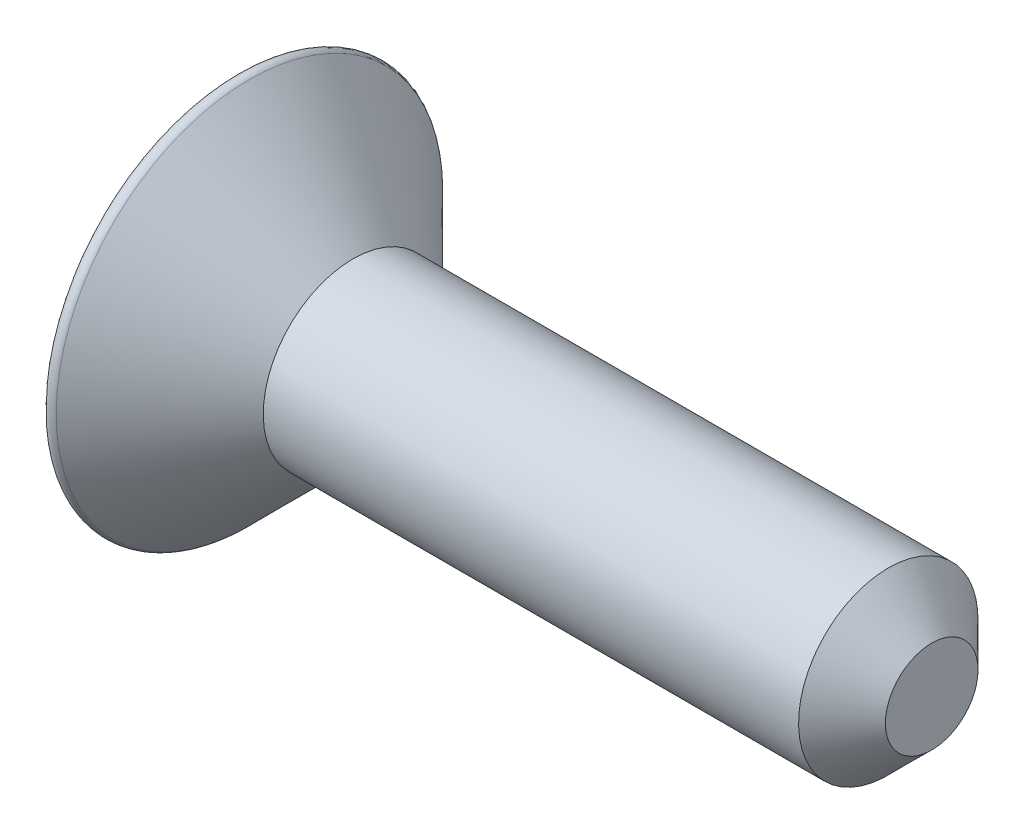
ISO-10303-21;
HEADER;
FILE_DESCRIPTION(('STEP AP214'),'2;1');
FILE_NAME('part.step','',(''),(''),'','','');
FILE_SCHEMA(('AUTOMOTIVE_DESIGN { 1 0 10303 214 1 1 1 1 }'));
ENDSEC;
DATA;
#1=APPLICATION_CONTEXT('core data for automotive mechanical design processes');
#2=APPLICATION_PROTOCOL_DEFINITION('international standard','automotive_design',2000,#1);
#3=PRODUCT_CONTEXT('',#1,'mechanical');
#4=PRODUCT('Part','Part','',(#3));
#5=PRODUCT_RELATED_PRODUCT_CATEGORY('part','',(#4));
#6=PRODUCT_DEFINITION_FORMATION('','',#4);
#7=PRODUCT_DEFINITION_CONTEXT('part definition',#1,'design');
#8=PRODUCT_DEFINITION('design','',#6,#7);
#9=PRODUCT_DEFINITION_SHAPE('','',#8);
#10=(LENGTH_UNIT() NAMED_UNIT(*) SI_UNIT(.MILLI.,.METRE.));
#11=(NAMED_UNIT(*) PLANE_ANGLE_UNIT() SI_UNIT($,.RADIAN.));
#12=(NAMED_UNIT(*) SI_UNIT($,.STERADIAN.) SOLID_ANGLE_UNIT());
#13=UNCERTAINTY_MEASURE_WITH_UNIT(LENGTH_MEASURE(1.E-05),#10,'distance_accuracy_value','');
#14=(GEOMETRIC_REPRESENTATION_CONTEXT(3) GLOBAL_UNCERTAINTY_ASSIGNED_CONTEXT((#13)) GLOBAL_UNIT_ASSIGNED_CONTEXT((#10,
#11,#12)) REPRESENTATION_CONTEXT('',''));
#15=CARTESIAN_POINT('',(0.,0.,0.));
#16=DIRECTION('',(0.,0.,1.));
#17=DIRECTION('',(1.,0.,0.));
#18=AXIS2_PLACEMENT_3D('',#15,#16,#17);
#19=CARTESIAN_POINT('',(0.,0.,0.));
#20=DIRECTION('',(1.00000000000002,0.,0.));
#21=DIRECTION('',(0.,1.00000000000002,0.));
#22=AXIS2_PLACEMENT_3D('',#19,#20,#21);
#23=PLANE('',#22);
#24=CARTESIAN_POINT('',(0.,0.,0.));
#25=DIRECTION('',(1.00000000000002,0.,0.));
#26=DIRECTION('',(0.,1.00000000000002,0.));
#27=AXIS2_PLACEMENT_3D('',#24,#25,#26);
#28=CIRCLE('',#27,0.812799999999999);
#29=CARTESIAN_POINT('',(0.,0.812800000000014,0.));
#30=VERTEX_POINT('',#29);
#31=EDGE_CURVE('E13',#30,#30,#28,.T.);
#32=ORIENTED_EDGE('',*,*,#31,.T.);
#33=EDGE_LOOP('',(#32));
#34=FACE_BOUND('',#33,.T.);
#35=ADVANCED_FACE('F50',(#34),#23,.T.);
#36=CARTESIAN_POINT('',(0.,0.,0.));
#37=DIRECTION('',(-1.00000000000002,0.,0.));
#38=DIRECTION('',(0.,-1.00000000000002,0.));
#39=AXIS2_PLACEMENT_3D('',#36,#37,#38);
#40=CONICAL_SURFACE('',#39,0.812799999999999,0.785398163397449);
#41=CARTESIAN_POINT('',(-0.76200000000004,-1.11022302462516E-13,0.));
#42=DIRECTION('',(1.00000000000002,0.,0.));
#43=DIRECTION('',(0.,1.00000000000002,0.));
#44=AXIS2_PLACEMENT_3D('',#41,#42,#43);
#45=CIRCLE('',#44,1.5748);
#46=CARTESIAN_POINT('',(-0.76200000000004,1.57479999999992,0.));
#47=VERTEX_POINT('',#46);
#48=EDGE_CURVE('E57',#47,#47,#45,.T.);
#49=ORIENTED_EDGE('',*,*,#48,.T.);
#50=EDGE_LOOP('',(#49));
#51=FACE_BOUND('',#50,.T.);
#52=ORIENTED_EDGE('',*,*,#31,.F.);
#53=EDGE_LOOP('',(#52));
#54=FACE_BOUND('',#53,.T.);
#55=ADVANCED_FACE('F208',(#51,#54),#40,.T.);
#56=CARTESIAN_POINT('',(0.,0.,0.));
#57=DIRECTION('',(1.00000000000002,0.,0.));
#58=DIRECTION('',(0.,1.00000000000002,0.));
#59=AXIS2_PLACEMENT_3D('',#56,#57,#58);
#60=CYLINDRICAL_SURFACE('',#59,1.5748);
#61=CARTESIAN_POINT('',(-10.1581948775786,-1.66533453693773E-13,0.));
#62=DIRECTION('',(1.00000000000002,0.,0.));
#63=DIRECTION('',(0.,1.00000000000002,0.));
#64=AXIS2_PLACEMENT_3D('',#61,#62,#63);
#65=CIRCLE('',#64,1.5748);
#66=CARTESIAN_POINT('',(-10.1581948775786,1.57479999999986,0.));
#67=VERTEX_POINT('',#66);
#68=EDGE_CURVE('E203',#67,#67,#65,.T.);
#69=ORIENTED_EDGE('',*,*,#68,.T.);
#70=EDGE_LOOP('',(#69));
#71=FACE_BOUND('',#70,.T.);
#72=ORIENTED_EDGE('',*,*,#48,.F.);
#73=EDGE_LOOP('',(#72));
#74=FACE_BOUND('',#73,.T.);
#75=ADVANCED_FACE('F211',(#71,#74),#60,.T.);
#76=CARTESIAN_POINT('',(-10.1581948775786,-1.66533453693773E-13,0.));
#77=DIRECTION('',(-1.00000000000002,0.,0.));
#78=DIRECTION('',(0.,-1.00000000000002,0.));
#79=AXIS2_PLACEMENT_3D('',#76,#77,#78);
#80=CONICAL_SURFACE('',#79,1.5748,0.785398163397453);
#81=CARTESIAN_POINT('',(-11.9751974387892,-3.05311331771918E-13,0.));
#82=DIRECTION('',(1.00000000000002,0.,0.));
#83=DIRECTION('',(0.,1.00000000000002,0.));
#84=AXIS2_PLACEMENT_3D('',#81,#82,#83);
#85=CIRCLE('',#84,3.39180256121069);
#86=CARTESIAN_POINT('',(-11.9751974387892,3.39180256121044,0.));
#87=VERTEX_POINT('',#86);
#88=EDGE_CURVE('E200',#87,#87,#85,.T.);
#89=ORIENTED_EDGE('',*,*,#88,.T.);
#90=EDGE_LOOP('',(#89));
#91=FACE_BOUND('',#90,.T.);
#92=ORIENTED_EDGE('',*,*,#68,.F.);
#93=EDGE_LOOP('',(#92));
#94=FACE_BOUND('',#93,.T.);
#95=ADVANCED_FACE('F213',(#91,#94),#80,.T.);
#96=CARTESIAN_POINT('',(-12.065,-3.33066907387547E-13,0.));
#97=DIRECTION('',(1.00000000000002,0.,0.));
#98=DIRECTION('',(0.,1.00000000000002,0.));
#99=AXIS2_PLACEMENT_3D('',#96,#97,#98);
#100=TOROIDAL_SURFACE('',#99,3.302,0.126999999999998);
#101=CARTESIAN_POINT('',(-12.1919999999999,-2.77555756156289E-13,0.));
#102=DIRECTION('',(1.00000000000002,0.,0.));
#103=DIRECTION('',(0.,1.00000000000002,0.));
#104=AXIS2_PLACEMENT_3D('',#101,#102,#103);
#105=CIRCLE('',#104,3.302);
#106=CARTESIAN_POINT('',(-12.1919999999999,3.30199999999978,0.));
#107=VERTEX_POINT('',#106);
#108=EDGE_CURVE('E197',#107,#107,#105,.T.);
#109=ORIENTED_EDGE('',*,*,#108,.T.);
#110=EDGE_LOOP('',(#109));
#111=FACE_BOUND('',#110,.T.);
#112=ORIENTED_EDGE('',*,*,#88,.F.);
#113=EDGE_LOOP('',(#112));
#114=FACE_BOUND('',#113,.T.);
#115=ADVANCED_FACE('F220',(#111,#114),#100,.T.);
#116=CARTESIAN_POINT('',(-12.1919999999999,-2.77555756156289E-13,0.));
#117=DIRECTION('',(-1.00000000000002,0.,0.));
#118=DIRECTION('',(0.,-1.00000000000002,0.));
#119=AXIS2_PLACEMENT_3D('',#116,#117,#118);
#120=PLANE('',#119);
#121=DIRECTION('',(0.,0.,-0.999999999999999));
#122=VECTOR('',#121,1.);
#123=CARTESIAN_POINT('',(-12.1919999999999,0.291765623733592,-0.292651894255841));
#124=LINE('',#123,#122);
#125=CARTESIAN_POINT('',(-12.1919999999999,0.291765623733592,-0.292651894255841));
#126=VERTEX_POINT('',#125);
#127=CARTESIAN_POINT('',(-12.1919999999999,0.291765623733592,-2.64590764398512));
#128=VERTEX_POINT('',#127);
#129=EDGE_CURVE('E146',#126,#128,#124,.T.);
#130=ORIENTED_EDGE('',*,*,#129,.F.);
#131=DIRECTION('',(0.,-1.00000000000002,0.));
#132=VECTOR('',#131,1.);
#133=CARTESIAN_POINT('',(-12.1919999999999,0.291765623733592,-0.292651894255841));
#134=LINE('',#133,#132);
#135=CARTESIAN_POINT('',(-12.1920000000001,2.65394488263848,-0.292651894255896));
#136=VERTEX_POINT('',#135);
#137=EDGE_CURVE('E125',#136,#126,#134,.T.);
#138=ORIENTED_EDGE('',*,*,#137,.F.);
#139=DIRECTION('',(0.,0.,-0.999999999999999));
#140=VECTOR('',#139,1.);
#141=CARTESIAN_POINT('',(-12.1920000000001,2.65394488263848,-0.292651894255896));
#142=LINE('',#141,#140);
#143=CARTESIAN_POINT('',(-12.1920000000001,2.6539448826383,0.292651894255994));
#144=VERTEX_POINT('',#143);
#145=EDGE_CURVE('E135',#144,#136,#142,.T.);
#146=ORIENTED_EDGE('',*,*,#145,.F.);
#147=DIRECTION('',(0.,1.00000000000002,0.));
#148=VECTOR('',#147,1.);
#149=CARTESIAN_POINT('',(-12.192,0.291765623733675,0.29265189425598));
#150=LINE('',#149,#148);
#151=CARTESIAN_POINT('',(-12.192,0.291765623733675,0.29265189425598));
#152=VERTEX_POINT('',#151);
#153=EDGE_CURVE('E132',#152,#144,#150,.T.);
#154=ORIENTED_EDGE('',*,*,#153,.F.);
#155=DIRECTION('',(0.,0.,-0.999999999999998));
#156=VECTOR('',#155,1.);
#157=CARTESIAN_POINT('',(-12.1919999999998,0.291765623733675,2.64590764398516));
#158=LINE('',#157,#156);
#159=CARTESIAN_POINT('',(-12.1919999999998,0.291765623733675,2.64590764398516));
#160=VERTEX_POINT('',#159);
#161=EDGE_CURVE('E169',#160,#152,#158,.T.);
#162=ORIENTED_EDGE('',*,*,#161,.F.);
#163=DIRECTION('',(0.,1.00000000000002,0.));
#164=VECTOR('',#163,1.);
#165=CARTESIAN_POINT('',(-12.1919999999998,0.291765623733675,2.64590764398516));
#166=LINE('',#165,#164);
#167=CARTESIAN_POINT('',(-12.192,-0.291765623733814,2.64590764398528));
#168=VERTEX_POINT('',#167);
#169=EDGE_CURVE('E166',#168,#160,#166,.T.);
#170=ORIENTED_EDGE('',*,*,#169,.F.);
#171=DIRECTION('',(0.,0.,0.999999999999999));
#172=VECTOR('',#171,1.);
#173=CARTESIAN_POINT('',(-12.192,-0.291765623733814,2.64590764398528));
#174=LINE('',#173,#172);
#175=CARTESIAN_POINT('',(-12.192,-0.291765623733869,0.292651894255896));
#176=VERTEX_POINT('',#175);
#177=EDGE_CURVE('E163',#176,#168,#174,.T.);
#178=ORIENTED_EDGE('',*,*,#177,.F.);
#179=DIRECTION('',(0.,1.00000000000002,0.));
#180=VECTOR('',#179,1.);
#181=CARTESIAN_POINT('',(-12.1920000000001,-2.65394488263881,0.292651894255896));
#182=LINE('',#181,#180);
#183=CARTESIAN_POINT('',(-12.1920000000001,-2.65394488263881,0.292651894255896));
#184=VERTEX_POINT('',#183);
#185=EDGE_CURVE('E160',#184,#176,#182,.T.);
#186=ORIENTED_EDGE('',*,*,#185,.F.);
#187=DIRECTION('',(0.,0.,0.999999999999999));
#188=VECTOR('',#187,1.);
#189=CARTESIAN_POINT('',(-12.192,-2.65394488263843,-0.292651894255896));
#190=LINE('',#189,#188);
#191=CARTESIAN_POINT('',(-12.192,-2.65394488263843,-0.292651894255896));
#192=VERTEX_POINT('',#191);
#193=EDGE_CURVE('E157',#192,#184,#190,.T.);
#194=ORIENTED_EDGE('',*,*,#193,.F.);
#195=DIRECTION('',(0.,-1.00000000000002,0.));
#196=VECTOR('',#195,1.);
#197=CARTESIAN_POINT('',(-12.192,-2.65394488263843,-0.292651894255896));
#198=LINE('',#197,#196);
#199=CARTESIAN_POINT('',(-12.1920000000002,-0.291765623734008,-0.292651894255855));
#200=VERTEX_POINT('',#199);
#201=EDGE_CURVE('E154',#200,#192,#198,.T.);
#202=ORIENTED_EDGE('',*,*,#201,.F.);
#203=DIRECTION('',(0.,0.,0.999999999999998));
#204=VECTOR('',#203,1.);
#205=CARTESIAN_POINT('',(-12.1920000000002,-0.291765623734008,-0.292651894255855));
#206=LINE('',#205,#204);
#207=CARTESIAN_POINT('',(-12.1919999999998,-0.291765623733828,-2.64590764398501));
#208=VERTEX_POINT('',#207);
#209=EDGE_CURVE('E64',#208,#200,#206,.T.);
#210=ORIENTED_EDGE('',*,*,#209,.F.);
#211=DIRECTION('',(0.,-1.00000000000002,0.));
#212=VECTOR('',#211,1.);
#213=CARTESIAN_POINT('',(-12.1919999999999,0.291765623733592,-2.64590764398512));
#214=LINE('',#213,#212);
#215=EDGE_CURVE('E148',#128,#208,#214,.T.);
#216=ORIENTED_EDGE('',*,*,#215,.F.);
#217=EDGE_LOOP('',(#130,#138,#146,#154,#162,#170,#178,#186,#194,#202,#210,#216));
#218=FACE_BOUND('',#217,.T.);
#219=ORIENTED_EDGE('',*,*,#108,.F.);
#220=EDGE_LOOP('',(#219));
#221=FACE_BOUND('',#220,.T.);
#222=ADVANCED_FACE('F142',(#218,#221),#120,.T.);
#223=CARTESIAN_POINT('',(-12.1920000000001,2.65394488263848,-0.292651894255896));
#224=DIRECTION('',(0.559192903470757,0.829037572555059,0.));
#225=DIRECTION('',(-0.829037572555059,0.559192903470757,0.));
#226=AXIS2_PLACEMENT_3D('',#223,#224,#225);
#227=PLANE('',#226);
#228=ORIENTED_EDGE('',*,*,#145,.T.);
#229=DIRECTION('',(-0.723589100218019,0.488067010791403,-0.488067010791394));
#230=VECTOR('',#229,1.);
#231=CARTESIAN_POINT('',(-12.1920000000001,2.65394488263848,-0.292651894255896));
#232=LINE('',#231,#230);
#233=CARTESIAN_POINT('',(-11.7581257242149,2.36129298838278,0.));
#234=VERTEX_POINT('',#233);
#235=EDGE_CURVE('E121',#234,#136,#232,.T.);
#236=ORIENTED_EDGE('',*,*,#235,.F.);
#237=DIRECTION('',(-0.723589100218015,0.488067010791404,0.488067010791394));
#238=VECTOR('',#237,1.);
#239=CARTESIAN_POINT('',(-11.3577728457167,2.09125156209314,-0.270041426289322));
#240=LINE('',#239,#238);
#241=EDGE_CURVE('E137',#234,#144,#240,.T.);
#242=ORIENTED_EDGE('',*,*,#241,.T.);
#243=EDGE_LOOP('',(#228,#236,#242));
#244=FACE_BOUND('',#243,.T.);
#245=ADVANCED_FACE('F136',(#244),#227,.F.);
#246=CARTESIAN_POINT('',(-12.1919999999998,0.291765623733675,2.64590764398516));
#247=DIRECTION('',(0.559192903470756,0.82903757255506,0.));
#248=DIRECTION('',(-0.829037572555059,0.559192903470757,0.));
#249=AXIS2_PLACEMENT_3D('',#246,#247,#248);
#250=PLANE('',#249);
#251=DIRECTION('',(-0.723589100218015,0.488067010791404,0.488067010791394));
#252=VECTOR('',#251,1.);
#253=CARTESIAN_POINT('',(-12.1919999999998,0.291765623733675,2.64590764398516));
#254=LINE('',#253,#252);
#255=CARTESIAN_POINT('',(-11.7594396742986,0.,2.35414202025115));
#256=VERTEX_POINT('',#255);
#257=EDGE_CURVE('E191',#256,#160,#254,.T.);
#258=ORIENTED_EDGE('',*,*,#257,.T.);
#259=ORIENTED_EDGE('',*,*,#161,.T.);
#260=DIRECTION('',(-0.723589100218015,0.488067010791404,0.488067010791394));
#261=VECTOR('',#260,1.);
#262=CARTESIAN_POINT('',(-12.192,0.291765623733675,0.29265189425598));
#263=LINE('',#262,#261);
#264=CARTESIAN_POINT('',(-11.7594396742987,-4.02455846426619E-13,0.000886270521971433));
#265=VERTEX_POINT('',#264);
#266=EDGE_CURVE('E174',#265,#152,#263,.T.);
#267=ORIENTED_EDGE('',*,*,#266,.F.);
#268=DIRECTION('',(0.,0.,-0.999999999999998));
#269=VECTOR('',#268,1.);
#270=CARTESIAN_POINT('',(-11.7594396742985,0.,2.64590764398517));
#271=LINE('',#270,#269);
#272=EDGE_CURVE('E173',#256,#265,#271,.T.);
#273=ORIENTED_EDGE('',*,*,#272,.F.);
#274=EDGE_LOOP('',(#258,#259,#267,#273));
#275=FACE_BOUND('',#274,.T.);
#276=ADVANCED_FACE('F260',(#275),#250,.F.);
#277=CARTESIAN_POINT('',(-12.1919999999998,0.291765623733675,2.64590764398516));
#278=DIRECTION('',(0.559192903470757,0.,0.82903757255504));
#279=DIRECTION('',(0.82903757255506,0.,-0.559192903470747));
#280=AXIS2_PLACEMENT_3D('',#277,#278,#279);
#281=PLANE('',#280);
#282=ORIENTED_EDGE('',*,*,#169,.T.);
#283=ORIENTED_EDGE('',*,*,#257,.F.);
#284=DIRECTION('',(-0.723589100218017,-0.488067010791403,0.488067010791393));
#285=VECTOR('',#284,1.);
#286=CARTESIAN_POINT('',(-12.192,-0.291765623733814,2.64590764398528));
#287=LINE('',#286,#285);
#288=EDGE_CURVE('E189',#256,#168,#287,.T.);
#289=ORIENTED_EDGE('',*,*,#288,.T.);
#290=EDGE_LOOP('',(#282,#283,#289));
#291=FACE_BOUND('',#290,.T.);
#292=ADVANCED_FACE('F267',(#291),#281,.F.);
#293=CARTESIAN_POINT('',(-12.192,-0.291765623733814,2.64590764398528));
#294=DIRECTION('',(0.559192903470756,-0.829037572555058,0.));
#295=DIRECTION('',(0.82903757255506,0.559192903470756,0.));
#296=AXIS2_PLACEMENT_3D('',#293,#294,#295);
#297=PLANE('',#296);
#298=ORIENTED_EDGE('',*,*,#272,.T.);
#299=DIRECTION('',(-0.723589100218017,-0.488067010791403,0.488067010791393));
#300=VECTOR('',#299,1.);
#301=CARTESIAN_POINT('',(-13.0230757280578,-0.852333280450313,0.853219550972048));
#302=LINE('',#301,#300);
#303=EDGE_CURVE('E187',#265,#176,#302,.T.);
#304=ORIENTED_EDGE('',*,*,#303,.T.);
#305=ORIENTED_EDGE('',*,*,#177,.T.);
#306=ORIENTED_EDGE('',*,*,#288,.F.);
#307=EDGE_LOOP('',(#298,#304,#305,#306));
#308=FACE_BOUND('',#307,.T.);
#309=ADVANCED_FACE('F275',(#308),#297,.F.);
#310=CARTESIAN_POINT('',(-12.1920000000001,-2.65394488263881,0.292651894255896));
#311=DIRECTION('',(0.559192903470757,0.,0.829037572555039));
#312=DIRECTION('',(0.82903757255506,0.,-0.559192903470747));
#313=AXIS2_PLACEMENT_3D('',#310,#311,#312);
#314=PLANE('',#313);
#315=DIRECTION('',(0.,1.00000000000002,0.));
#316=VECTOR('',#315,1.);
#317=CARTESIAN_POINT('',(-11.7581257242149,-2.6539448826384,0.));
#318=LINE('',#317,#316);
#319=CARTESIAN_POINT('',(-11.758125724215,-2.36129298838279,2.08166817117217E-13));
#320=VERTEX_POINT('',#319);
#321=EDGE_CURVE('E128',#320,#234,#318,.T.);
#322=ORIENTED_EDGE('',*,*,#321,.F.);
#323=DIRECTION('',(-0.723589100218017,-0.488067010791403,0.488067010791393));
#324=VECTOR('',#323,1.);
#325=CARTESIAN_POINT('',(-11.9852941320854,-2.51452001424883,0.153227025866245));
#326=LINE('',#325,#324);
#327=EDGE_CURVE('E185',#320,#184,#326,.T.);
#328=ORIENTED_EDGE('',*,*,#327,.T.);
#329=ORIENTED_EDGE('',*,*,#185,.T.);
#330=ORIENTED_EDGE('',*,*,#303,.F.);
#331=ORIENTED_EDGE('',*,*,#266,.T.);
#332=ORIENTED_EDGE('',*,*,#153,.T.);
#333=ORIENTED_EDGE('',*,*,#241,.F.);
#334=EDGE_LOOP('',(#322,#328,#329,#330,#331,#332,#333));
#335=FACE_BOUND('',#334,.T.);
#336=ADVANCED_FACE('F283',(#335),#314,.F.);
#337=CARTESIAN_POINT('',(-12.192,-2.65394488263843,-0.292651894255896));
#338=DIRECTION('',(0.559192903470756,-0.829037572555058,0.));
#339=DIRECTION('',(0.82903757255506,0.559192903470756,0.));
#340=AXIS2_PLACEMENT_3D('',#337,#338,#339);
#341=PLANE('',#340);
#342=ORIENTED_EDGE('',*,*,#193,.T.);
#343=ORIENTED_EDGE('',*,*,#327,.F.);
#344=DIRECTION('',(-0.72358910021802,-0.488067010791404,-0.488067010791394));
#345=VECTOR('',#344,1.);
#346=CARTESIAN_POINT('',(-12.192,-2.65394488263843,-0.292651894255896));
#347=LINE('',#346,#345);
#348=EDGE_CURVE('E183',#320,#192,#347,.T.);
#349=ORIENTED_EDGE('',*,*,#348,.T.);
#350=EDGE_LOOP('',(#342,#343,#349));
#351=FACE_BOUND('',#350,.T.);
#352=ADVANCED_FACE('F291',(#351),#341,.F.);
#353=CARTESIAN_POINT('',(-12.1920000000002,-0.291765623734008,-0.292651894255855));
#354=DIRECTION('',(0.559192903470756,-0.829037572555058,0.));
#355=DIRECTION('',(0.82903757255506,0.559192903470756,0.));
#356=AXIS2_PLACEMENT_3D('',#353,#354,#355);
#357=PLANE('',#356);
#358=DIRECTION('',(-0.72358910021802,-0.488067010791404,-0.488067010791394));
#359=VECTOR('',#358,1.);
#360=CARTESIAN_POINT('',(-11.985920122626,-0.152762991295505,-2.5069050115465));
#361=LINE('',#360,#359);
#362=CARTESIAN_POINT('',(-11.7594396742985,0.,-2.3541420202511));
#363=VERTEX_POINT('',#362);
#364=EDGE_CURVE('E179',#363,#208,#361,.T.);
#365=ORIENTED_EDGE('',*,*,#364,.T.);
#366=ORIENTED_EDGE('',*,*,#209,.T.);
#367=DIRECTION('',(-0.72358910021802,-0.488067010791404,-0.488067010791394));
#368=VECTOR('',#367,1.);
#369=CARTESIAN_POINT('',(-13.0262271542833,-0.854458944279379,-0.855345214800976));
#370=LINE('',#369,#368);
#371=CARTESIAN_POINT('',(-11.7594396742986,-2.35922392732846E-13,-0.000886270521915922));
#372=VERTEX_POINT('',#371);
#373=EDGE_CURVE('E181',#372,#200,#370,.T.);
#374=ORIENTED_EDGE('',*,*,#373,.F.);
#375=DIRECTION('',(0.,0.,0.999999999999998));
#376=VECTOR('',#375,1.);
#377=CARTESIAN_POINT('',(-11.7594396742984,-2.91433543964104E-13,-0.292651894255772));
#378=LINE('',#377,#376);
#379=EDGE_CURVE('E72',#363,#372,#378,.T.);
#380=ORIENTED_EDGE('',*,*,#379,.F.);
#381=EDGE_LOOP('',(#365,#366,#374,#380));
#382=FACE_BOUND('',#381,.T.);
#383=ADVANCED_FACE('F302',(#382),#357,.F.);
#384=CARTESIAN_POINT('',(-12.1919999999999,0.291765623733592,-2.64590764398512));
#385=DIRECTION('',(0.559192903470756,0.,-0.829037572555041));
#386=DIRECTION('',(-0.829037572555059,0.,-0.559192903470746));
#387=AXIS2_PLACEMENT_3D('',#384,#385,#386);
#388=PLANE('',#387);
#389=ORIENTED_EDGE('',*,*,#215,.T.);
#390=ORIENTED_EDGE('',*,*,#364,.F.);
#391=DIRECTION('',(-0.723589100218019,0.488067010791403,-0.488067010791394));
#392=VECTOR('',#391,1.);
#393=CARTESIAN_POINT('',(-11.360924271942,-0.268802032982296,-2.08533998726901));
#394=LINE('',#393,#392);
#395=EDGE_CURVE('E177',#363,#128,#394,.T.);
#396=ORIENTED_EDGE('',*,*,#395,.T.);
#397=EDGE_LOOP('',(#389,#390,#396));
#398=FACE_BOUND('',#397,.T.);
#399=ADVANCED_FACE('F310',(#398),#388,.F.);
#400=CARTESIAN_POINT('',(-12.1919999999999,0.291765623733592,-0.292651894255841));
#401=DIRECTION('',(0.559192903470757,0.829037572555059,0.));
#402=DIRECTION('',(-0.829037572555059,0.559192903470757,0.));
#403=AXIS2_PLACEMENT_3D('',#400,#401,#402);
#404=PLANE('',#403);
#405=ORIENTED_EDGE('',*,*,#379,.T.);
#406=DIRECTION('',(-0.723589100218019,0.488067010791403,-0.488067010791394));
#407=VECTOR('',#406,1.);
#408=CARTESIAN_POINT('',(-12.1919999999999,0.291765623733592,-0.292651894255841));
#409=LINE('',#408,#407);
#410=EDGE_CURVE('E131',#372,#126,#409,.T.);
#411=ORIENTED_EDGE('',*,*,#410,.T.);
#412=ORIENTED_EDGE('',*,*,#129,.T.);
#413=ORIENTED_EDGE('',*,*,#395,.F.);
#414=EDGE_LOOP('',(#405,#411,#412,#413));
#415=FACE_BOUND('',#414,.T.);
#416=ADVANCED_FACE('F317',(#415),#404,.F.);
#417=CARTESIAN_POINT('',(-12.1919999999999,0.291765623733592,-0.292651894255841));
#418=DIRECTION('',(0.559192903470756,0.,-0.829037572555041));
#419=DIRECTION('',(-0.829037572555059,0.,-0.559192903470746));
#420=AXIS2_PLACEMENT_3D('',#417,#418,#419);
#421=PLANE('',#420);
#422=ORIENTED_EDGE('',*,*,#235,.T.);
#423=ORIENTED_EDGE('',*,*,#137,.T.);
#424=ORIENTED_EDGE('',*,*,#410,.F.);
#425=ORIENTED_EDGE('',*,*,#373,.T.);
#426=ORIENTED_EDGE('',*,*,#201,.T.);
#427=ORIENTED_EDGE('',*,*,#348,.F.);
#428=ORIENTED_EDGE('',*,*,#321,.T.);
#429=EDGE_LOOP('',(#422,#423,#424,#425,#426,#427,#428));
#430=FACE_BOUND('',#429,.T.);
#431=ADVANCED_FACE('F123',(#430),#421,.F.);
#432=CLOSED_SHELL('',(#35,#55,#75,#95,#115,#222,#245,#276,#292,#309,#336,#352,#383,#399,#416,#431));
#433=MANIFOLD_SOLID_BREP('B2',#432);
#434=ADVANCED_BREP_SHAPE_REPRESENTATION('',(#18,#433),#14);
#435=SHAPE_DEFINITION_REPRESENTATION(#9,#434);
ENDSEC;
END-ISO-10303-21;
